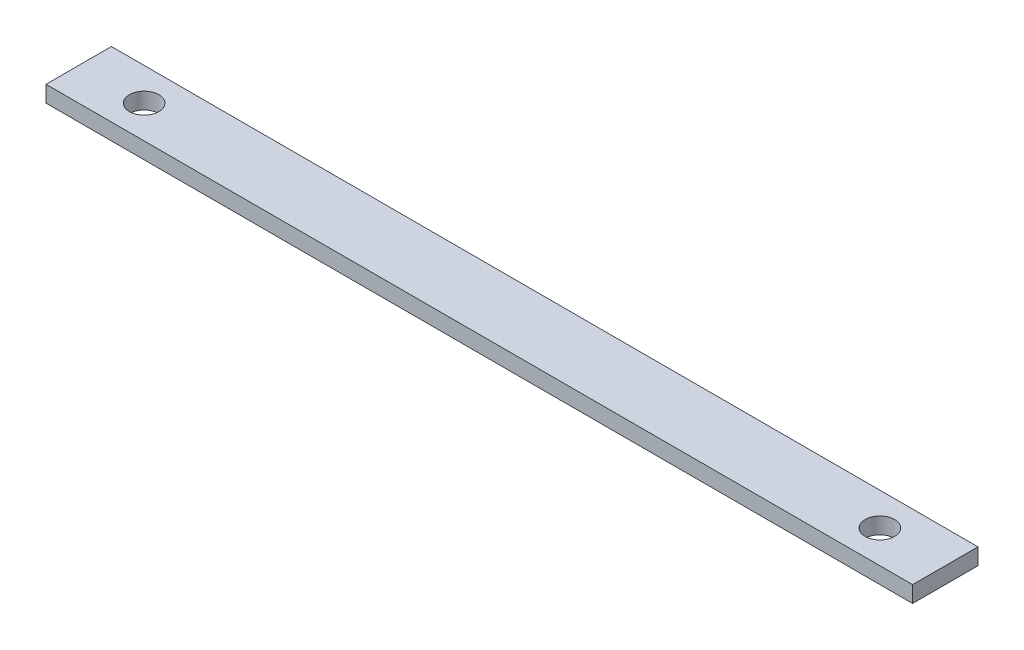
ISO-10303-21;
HEADER;
FILE_DESCRIPTION(('STEP AP214'),'2;1');
FILE_NAME('part.step','',(''),(''),'','','');
FILE_SCHEMA(('AUTOMOTIVE_DESIGN { 1 0 10303 214 1 1 1 1 }'));
ENDSEC;
DATA;
#1=APPLICATION_CONTEXT('core data for automotive mechanical design processes');
#2=APPLICATION_PROTOCOL_DEFINITION('international standard','automotive_design',2000,#1);
#3=PRODUCT_CONTEXT('',#1,'mechanical');
#4=PRODUCT('Part','Part','',(#3));
#5=PRODUCT_RELATED_PRODUCT_CATEGORY('part','',(#4));
#6=PRODUCT_DEFINITION_FORMATION('','',#4);
#7=PRODUCT_DEFINITION_CONTEXT('part definition',#1,'design');
#8=PRODUCT_DEFINITION('design','',#6,#7);
#9=PRODUCT_DEFINITION_SHAPE('','',#8);
#10=(LENGTH_UNIT() NAMED_UNIT(*) SI_UNIT(.MILLI.,.METRE.));
#11=(NAMED_UNIT(*) PLANE_ANGLE_UNIT() SI_UNIT($,.RADIAN.));
#12=(NAMED_UNIT(*) SI_UNIT($,.STERADIAN.) SOLID_ANGLE_UNIT());
#13=UNCERTAINTY_MEASURE_WITH_UNIT(LENGTH_MEASURE(1.E-05),#10,'distance_accuracy_value','');
#14=(GEOMETRIC_REPRESENTATION_CONTEXT(3) GLOBAL_UNCERTAINTY_ASSIGNED_CONTEXT((#13)) GLOBAL_UNIT_ASSIGNED_CONTEXT((#10,
#11,#12)) REPRESENTATION_CONTEXT('',''));
#15=CARTESIAN_POINT('',(0.,0.,0.));
#16=DIRECTION('',(0.,0.,1.));
#17=DIRECTION('',(1.,0.,0.));
#18=AXIS2_PLACEMENT_3D('',#15,#16,#17);
#19=CARTESIAN_POINT('',(-67.31,-12.7,-5.08));
#20=DIRECTION('',(-1.,0.,0.));
#21=DIRECTION('',(0.,0.,1.));
#22=AXIS2_PLACEMENT_3D('',#19,#20,#21);
#23=PLANE('',#22);
#24=DIRECTION('',(0.,0.,1.));
#25=VECTOR('',#24,1.);
#26=CARTESIAN_POINT('',(-67.31,-10.16,-5.08));
#27=LINE('',#26,#25);
#28=CARTESIAN_POINT('',(-67.31,-10.16,-5.08));
#29=VERTEX_POINT('',#28);
#30=CARTESIAN_POINT('',(-67.31,-10.16,5.08));
#31=VERTEX_POINT('',#30);
#32=EDGE_CURVE('E100',#29,#31,#27,.T.);
#33=ORIENTED_EDGE('',*,*,#32,.F.);
#34=DIRECTION('',(0.,1.,0.));
#35=VECTOR('',#34,1.);
#36=CARTESIAN_POINT('',(-67.31,-12.7,-5.08));
#37=LINE('',#36,#35);
#38=CARTESIAN_POINT('',(-67.31,-12.7,-5.08));
#39=VERTEX_POINT('',#38);
#40=EDGE_CURVE('E11',#39,#29,#37,.T.);
#41=ORIENTED_EDGE('',*,*,#40,.F.);
#42=DIRECTION('',(0.,0.,1.));
#43=VECTOR('',#42,1.);
#44=CARTESIAN_POINT('',(-67.31,-12.7,-5.08));
#45=LINE('',#44,#43);
#46=CARTESIAN_POINT('',(-67.31,-12.7,5.08));
#47=VERTEX_POINT('',#46);
#48=EDGE_CURVE('E93',#39,#47,#45,.T.);
#49=ORIENTED_EDGE('',*,*,#48,.T.);
#50=DIRECTION('',(0.,1.,0.));
#51=VECTOR('',#50,1.);
#52=CARTESIAN_POINT('',(-67.31,-12.7,5.08));
#53=LINE('',#52,#51);
#54=EDGE_CURVE('E38',#47,#31,#53,.T.);
#55=ORIENTED_EDGE('',*,*,#54,.T.);
#56=EDGE_LOOP('',(#33,#41,#49,#55));
#57=FACE_BOUND('',#56,.T.);
#58=ADVANCED_FACE('F35',(#57),#23,.T.);
#59=CARTESIAN_POINT('',(-67.31,-12.7,-5.08));
#60=DIRECTION('',(0.,0.,-1.));
#61=DIRECTION('',(-1.,0.,0.));
#62=AXIS2_PLACEMENT_3D('',#59,#60,#61);
#63=PLANE('',#62);
#64=DIRECTION('',(-1.,0.,0.));
#65=VECTOR('',#64,1.);
#66=CARTESIAN_POINT('',(-67.31,-10.16,-5.08));
#67=LINE('',#66,#65);
#68=CARTESIAN_POINT('',(67.31,-10.16,-5.08));
#69=VERTEX_POINT('',#68);
#70=EDGE_CURVE('E95',#69,#29,#67,.T.);
#71=ORIENTED_EDGE('',*,*,#70,.F.);
#72=DIRECTION('',(0.,1.,0.));
#73=VECTOR('',#72,1.);
#74=CARTESIAN_POINT('',(67.31,-12.7,-5.08));
#75=LINE('',#74,#73);
#76=CARTESIAN_POINT('',(67.31,-12.7,-5.08));
#77=VERTEX_POINT('',#76);
#78=EDGE_CURVE('E44',#77,#69,#75,.T.);
#79=ORIENTED_EDGE('',*,*,#78,.F.);
#80=DIRECTION('',(-1.,0.,0.));
#81=VECTOR('',#80,1.);
#82=CARTESIAN_POINT('',(-67.31,-12.7,-5.08));
#83=LINE('',#82,#81);
#84=EDGE_CURVE('E90',#77,#39,#83,.T.);
#85=ORIENTED_EDGE('',*,*,#84,.T.);
#86=ORIENTED_EDGE('',*,*,#40,.T.);
#87=EDGE_LOOP('',(#71,#79,#85,#86));
#88=FACE_BOUND('',#87,.T.);
#89=ADVANCED_FACE('F111',(#88),#63,.T.);
#90=CARTESIAN_POINT('',(67.31,-12.7,-5.08));
#91=DIRECTION('',(1.,0.,0.));
#92=DIRECTION('',(0.,0.,-1.));
#93=AXIS2_PLACEMENT_3D('',#90,#91,#92);
#94=PLANE('',#93);
#95=DIRECTION('',(0.,0.,-1.));
#96=VECTOR('',#95,1.);
#97=CARTESIAN_POINT('',(67.31,-10.16,-5.08));
#98=LINE('',#97,#96);
#99=CARTESIAN_POINT('',(67.31,-10.16,5.08));
#100=VERTEX_POINT('',#99);
#101=EDGE_CURVE('E85',#100,#69,#98,.T.);
#102=ORIENTED_EDGE('',*,*,#101,.F.);
#103=DIRECTION('',(0.,1.,0.));
#104=VECTOR('',#103,1.);
#105=CARTESIAN_POINT('',(67.31,-12.7,5.08));
#106=LINE('',#105,#104);
#107=CARTESIAN_POINT('',(67.31,-12.7,5.08));
#108=VERTEX_POINT('',#107);
#109=EDGE_CURVE('E80',#108,#100,#106,.T.);
#110=ORIENTED_EDGE('',*,*,#109,.F.);
#111=DIRECTION('',(0.,0.,-1.));
#112=VECTOR('',#111,1.);
#113=CARTESIAN_POINT('',(67.31,-12.7,-5.08));
#114=LINE('',#113,#112);
#115=EDGE_CURVE('E83',#108,#77,#114,.T.);
#116=ORIENTED_EDGE('',*,*,#115,.T.);
#117=ORIENTED_EDGE('',*,*,#78,.T.);
#118=EDGE_LOOP('',(#102,#110,#116,#117));
#119=FACE_BOUND('',#118,.T.);
#120=ADVANCED_FACE('F82',(#119),#94,.T.);
#121=CARTESIAN_POINT('',(-67.31,-12.7,5.08));
#122=DIRECTION('',(0.,0.,1.));
#123=DIRECTION('',(1.,0.,0.));
#124=AXIS2_PLACEMENT_3D('',#121,#122,#123);
#125=PLANE('',#124);
#126=DIRECTION('',(1.,0.,0.));
#127=VECTOR('',#126,1.);
#128=CARTESIAN_POINT('',(-67.31,-10.16,5.08));
#129=LINE('',#128,#127);
#130=EDGE_CURVE('E103',#31,#100,#129,.T.);
#131=ORIENTED_EDGE('',*,*,#130,.F.);
#132=ORIENTED_EDGE('',*,*,#54,.F.);
#133=DIRECTION('',(1.,0.,0.));
#134=VECTOR('',#133,1.);
#135=CARTESIAN_POINT('',(-67.31,-12.7,5.08));
#136=LINE('',#135,#134);
#137=EDGE_CURVE('E89',#47,#108,#136,.T.);
#138=ORIENTED_EDGE('',*,*,#137,.T.);
#139=ORIENTED_EDGE('',*,*,#109,.T.);
#140=EDGE_LOOP('',(#131,#132,#138,#139));
#141=FACE_BOUND('',#140,.T.);
#142=ADVANCED_FACE('F92',(#141),#125,.T.);
#143=CARTESIAN_POINT('',(0.,-12.7,0.));
#144=DIRECTION('',(0.,1.,0.));
#145=DIRECTION('',(0.,0.,1.));
#146=AXIS2_PLACEMENT_3D('',#143,#144,#145);
#147=PLANE('',#146);
#148=CARTESIAN_POINT('',(57.15,-12.7,0.));
#149=DIRECTION('',(0.,1.,0.));
#150=DIRECTION('',(0.,0.,1.));
#151=AXIS2_PLACEMENT_3D('',#148,#149,#150);
#152=CIRCLE('',#151,2.286);
#153=CARTESIAN_POINT('',(57.15,-12.7,2.286));
#154=VERTEX_POINT('',#153);
#155=EDGE_CURVE('E144',#154,#154,#152,.T.);
#156=ORIENTED_EDGE('',*,*,#155,.T.);
#157=EDGE_LOOP('',(#156));
#158=FACE_BOUND('',#157,.T.);
#159=CARTESIAN_POINT('',(-57.15,-12.7,0.));
#160=DIRECTION('',(0.,1.,0.));
#161=DIRECTION('',(0.,0.,1.));
#162=AXIS2_PLACEMENT_3D('',#159,#160,#161);
#163=CIRCLE('',#162,2.286);
#164=CARTESIAN_POINT('',(-57.15,-12.7,2.286));
#165=VERTEX_POINT('',#164);
#166=EDGE_CURVE('E104',#165,#165,#163,.T.);
#167=ORIENTED_EDGE('',*,*,#166,.T.);
#168=EDGE_LOOP('',(#167));
#169=FACE_BOUND('',#168,.T.);
#170=ORIENTED_EDGE('',*,*,#48,.F.);
#171=ORIENTED_EDGE('',*,*,#84,.F.);
#172=ORIENTED_EDGE('',*,*,#115,.F.);
#173=ORIENTED_EDGE('',*,*,#137,.F.);
#174=EDGE_LOOP('',(#170,#171,#172,#173));
#175=FACE_BOUND('',#174,.T.);
#176=ADVANCED_FACE('F88',(#158,#169,#175),#147,.F.);
#177=CARTESIAN_POINT('',(0.,-10.16,0.));
#178=DIRECTION('',(0.,1.,0.));
#179=DIRECTION('',(0.,0.,1.));
#180=AXIS2_PLACEMENT_3D('',#177,#178,#179);
#181=PLANE('',#180);
#182=CARTESIAN_POINT('',(57.15,-10.16,0.));
#183=DIRECTION('',(0.,1.,0.));
#184=DIRECTION('',(0.,0.,1.));
#185=AXIS2_PLACEMENT_3D('',#182,#183,#184);
#186=CIRCLE('',#185,2.286);
#187=CARTESIAN_POINT('',(57.15,-10.16,2.286));
#188=VERTEX_POINT('',#187);
#189=EDGE_CURVE('E147',#188,#188,#186,.T.);
#190=ORIENTED_EDGE('',*,*,#189,.F.);
#191=EDGE_LOOP('',(#190));
#192=FACE_BOUND('',#191,.T.);
#193=CARTESIAN_POINT('',(-57.15,-10.16,0.));
#194=DIRECTION('',(0.,1.,0.));
#195=DIRECTION('',(0.,0.,1.));
#196=AXIS2_PLACEMENT_3D('',#193,#194,#195);
#197=CIRCLE('',#196,2.286);
#198=CARTESIAN_POINT('',(-57.15,-10.16,2.286));
#199=VERTEX_POINT('',#198);
#200=EDGE_CURVE('E149',#199,#199,#197,.T.);
#201=ORIENTED_EDGE('',*,*,#200,.F.);
#202=EDGE_LOOP('',(#201));
#203=FACE_BOUND('',#202,.T.);
#204=ORIENTED_EDGE('',*,*,#32,.T.);
#205=ORIENTED_EDGE('',*,*,#130,.T.);
#206=ORIENTED_EDGE('',*,*,#101,.T.);
#207=ORIENTED_EDGE('',*,*,#70,.T.);
#208=EDGE_LOOP('',(#204,#205,#206,#207));
#209=FACE_BOUND('',#208,.T.);
#210=ADVANCED_FACE('F110',(#192,#203,#209),#181,.T.);
#211=CARTESIAN_POINT('',(-57.15,-12.7,0.));
#212=DIRECTION('',(0.,1.,0.));
#213=DIRECTION('',(0.,0.,1.));
#214=AXIS2_PLACEMENT_3D('',#211,#212,#213);
#215=CYLINDRICAL_SURFACE('',#214,2.286);
#216=ORIENTED_EDGE('',*,*,#166,.F.);
#217=EDGE_LOOP('',(#216));
#218=FACE_BOUND('',#217,.T.);
#219=ORIENTED_EDGE('',*,*,#200,.T.);
#220=EDGE_LOOP('',(#219));
#221=FACE_BOUND('',#220,.T.);
#222=ADVANCED_FACE('F129',(#218,#221),#215,.F.);
#223=CARTESIAN_POINT('',(57.15,-12.7,0.));
#224=DIRECTION('',(0.,1.,0.));
#225=DIRECTION('',(0.,0.,1.));
#226=AXIS2_PLACEMENT_3D('',#223,#224,#225);
#227=CYLINDRICAL_SURFACE('',#226,2.286);
#228=ORIENTED_EDGE('',*,*,#155,.F.);
#229=EDGE_LOOP('',(#228));
#230=FACE_BOUND('',#229,.T.);
#231=ORIENTED_EDGE('',*,*,#189,.T.);
#232=EDGE_LOOP('',(#231));
#233=FACE_BOUND('',#232,.T.);
#234=ADVANCED_FACE('F136',(#230,#233),#227,.F.);
#235=CLOSED_SHELL('',(#58,#89,#120,#142,#176,#210,#222,#234));
#236=MANIFOLD_SOLID_BREP('B2',#235);
#237=ADVANCED_BREP_SHAPE_REPRESENTATION('',(#18,#236),#14);
#238=SHAPE_DEFINITION_REPRESENTATION(#9,#237);
ENDSEC;
END-ISO-10303-21;
